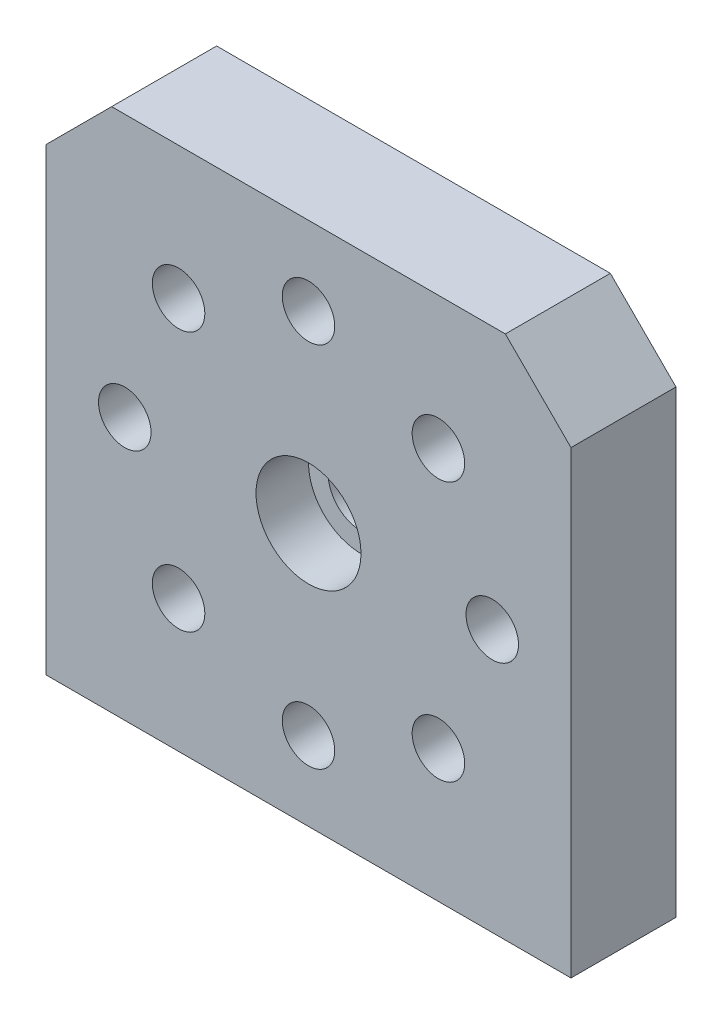
ISO-10303-21;
HEADER;
FILE_DESCRIPTION(('STEP AP214'),'2;1');
FILE_NAME('part.step','',(''),(''),'','','');
FILE_SCHEMA(('AUTOMOTIVE_DESIGN { 1 0 10303 214 1 1 1 1 }'));
ENDSEC;
DATA;
#1=APPLICATION_CONTEXT('core data for automotive mechanical design processes');
#2=APPLICATION_PROTOCOL_DEFINITION('international standard','automotive_design',2000,#1);
#3=PRODUCT_CONTEXT('',#1,'mechanical');
#4=PRODUCT('Part','Part','',(#3));
#5=PRODUCT_RELATED_PRODUCT_CATEGORY('part','',(#4));
#6=PRODUCT_DEFINITION_FORMATION('','',#4);
#7=PRODUCT_DEFINITION_CONTEXT('part definition',#1,'design');
#8=PRODUCT_DEFINITION('design','',#6,#7);
#9=PRODUCT_DEFINITION_SHAPE('','',#8);
#10=(LENGTH_UNIT() NAMED_UNIT(*) SI_UNIT(.MILLI.,.METRE.));
#11=(NAMED_UNIT(*) PLANE_ANGLE_UNIT() SI_UNIT($,.RADIAN.));
#12=(NAMED_UNIT(*) SI_UNIT($,.STERADIAN.) SOLID_ANGLE_UNIT());
#13=UNCERTAINTY_MEASURE_WITH_UNIT(LENGTH_MEASURE(1.E-05),#10,'distance_accuracy_value','');
#14=(GEOMETRIC_REPRESENTATION_CONTEXT(3) GLOBAL_UNCERTAINTY_ASSIGNED_CONTEXT((#13)) GLOBAL_UNIT_ASSIGNED_CONTEXT((#10,
#11,#12)) REPRESENTATION_CONTEXT('',''));
#15=CARTESIAN_POINT('',(0.,0.,0.));
#16=DIRECTION('',(0.,0.,1.));
#17=DIRECTION('',(1.,0.,0.));
#18=AXIS2_PLACEMENT_3D('',#15,#16,#17);
#19=CARTESIAN_POINT('',(0.,0.,8.));
#20=DIRECTION('',(0.,0.,-1.));
#21=DIRECTION('',(-1.,0.,0.));
#22=AXIS2_PLACEMENT_3D('',#19,#20,#21);
#23=CYLINDRICAL_SURFACE('',#22,2.5);
#24=CARTESIAN_POINT('',(0.,0.,0.));
#25=DIRECTION('',(0.,0.,1.));
#26=DIRECTION('',(1.,0.,0.));
#27=AXIS2_PLACEMENT_3D('',#24,#25,#26);
#28=CIRCLE('',#27,2.5);
#29=CARTESIAN_POINT('',(2.5,0.,0.));
#30=VERTEX_POINT('',#29);
#31=EDGE_CURVE('E122',#30,#30,#28,.T.);
#32=ORIENTED_EDGE('',*,*,#31,.F.);
#33=EDGE_LOOP('',(#32));
#34=FACE_BOUND('',#33,.T.);
#35=CARTESIAN_POINT('',(0.,0.,4.));
#36=DIRECTION('',(0.,0.,1.));
#37=DIRECTION('',(1.,0.,0.));
#38=AXIS2_PLACEMENT_3D('',#35,#36,#37);
#39=CIRCLE('',#38,2.5);
#40=CARTESIAN_POINT('',(2.5,0.,4.));
#41=VERTEX_POINT('',#40);
#42=EDGE_CURVE('E35',#41,#41,#39,.T.);
#43=ORIENTED_EDGE('',*,*,#42,.T.);
#44=EDGE_LOOP('',(#43));
#45=FACE_BOUND('',#44,.T.);
#46=ADVANCED_FACE('F31',(#34,#45),#23,.F.);
#47=CARTESIAN_POINT('',(-20.,-20.,8.));
#48=DIRECTION('',(0.,0.,-1.));
#49=DIRECTION('',(-1.,0.,0.));
#50=AXIS2_PLACEMENT_3D('',#47,#48,#49);
#51=PLANE('',#50);
#52=CARTESIAN_POINT('',(0.,0.,8.));
#53=DIRECTION('',(0.,0.,1.));
#54=DIRECTION('',(1.,0.,0.));
#55=AXIS2_PLACEMENT_3D('',#52,#53,#54);
#56=CIRCLE('',#55,4.);
#57=CARTESIAN_POINT('',(4.,0.,8.));
#58=VERTEX_POINT('',#57);
#59=EDGE_CURVE('E319',#58,#58,#56,.T.);
#60=ORIENTED_EDGE('',*,*,#59,.F.);
#61=EDGE_LOOP('',(#60));
#62=FACE_BOUND('',#61,.T.);
#63=CARTESIAN_POINT('',(-13.9999999999998,-2.04602083981807E-13,8.));
#64=DIRECTION('',(0.,0.,1.));
#65=DIRECTION('',(1.,0.,0.));
#66=AXIS2_PLACEMENT_3D('',#63,#64,#65);
#67=CIRCLE('',#66,2.00000000000039);
#68=CARTESIAN_POINT('',(-11.9999999999994,-2.04602083981807E-13,8.));
#69=VERTEX_POINT('',#68);
#70=EDGE_CURVE('E228',#69,#69,#67,.T.);
#71=ORIENTED_EDGE('',*,*,#70,.F.);
#72=EDGE_LOOP('',(#71));
#73=FACE_BOUND('',#72,.T.);
#74=CARTESIAN_POINT('',(3.98903336916386E-13,-14.,8.));
#75=DIRECTION('',(0.,0.,1.));
#76=DIRECTION('',(1.,0.,0.));
#77=AXIS2_PLACEMENT_3D('',#74,#75,#76);
#78=CIRCLE('',#77,2.00000000000047);
#79=CARTESIAN_POINT('',(2.00000000000087,-14.,8.));
#80=VERTEX_POINT('',#79);
#81=EDGE_CURVE('E236',#80,#80,#78,.T.);
#82=ORIENTED_EDGE('',*,*,#81,.F.);
#83=EDGE_LOOP('',(#82));
#84=FACE_BOUND('',#83,.T.);
#85=CARTESIAN_POINT('',(14.,0.,8.));
#86=DIRECTION('',(0.,0.,1.));
#87=DIRECTION('',(1.,0.,0.));
#88=AXIS2_PLACEMENT_3D('',#85,#86,#87);
#89=CIRCLE('',#88,2.);
#90=CARTESIAN_POINT('',(16.,0.,8.));
#91=VERTEX_POINT('',#90);
#92=EDGE_CURVE('E244',#91,#91,#89,.T.);
#93=ORIENTED_EDGE('',*,*,#92,.F.);
#94=EDGE_LOOP('',(#93));
#95=FACE_BOUND('',#94,.T.);
#96=CARTESIAN_POINT('',(0.,14.,8.));
#97=DIRECTION('',(0.,0.,1.));
#98=DIRECTION('',(1.,0.,0.));
#99=AXIS2_PLACEMENT_3D('',#96,#97,#98);
#100=CIRCLE('',#99,2.);
#101=CARTESIAN_POINT('',(2.,14.,8.));
#102=VERTEX_POINT('',#101);
#103=EDGE_CURVE('E191',#102,#102,#100,.T.);
#104=ORIENTED_EDGE('',*,*,#103,.F.);
#105=EDGE_LOOP('',(#104));
#106=FACE_BOUND('',#105,.T.);
#107=DIRECTION('',(1.,0.,0.));
#108=VECTOR('',#107,1.);
#109=CARTESIAN_POINT('',(20.,-20.,8.));
#110=LINE('',#109,#108);
#111=CARTESIAN_POINT('',(-20.,-20.,8.));
#112=VERTEX_POINT('',#111);
#113=CARTESIAN_POINT('',(20.,-20.,8.));
#114=VERTEX_POINT('',#113);
#115=EDGE_CURVE('E129',#112,#114,#110,.T.);
#116=ORIENTED_EDGE('',*,*,#115,.T.);
#117=DIRECTION('',(0.,1.,0.));
#118=VECTOR('',#117,1.);
#119=CARTESIAN_POINT('',(20.,15.,8.));
#120=LINE('',#119,#118);
#121=CARTESIAN_POINT('',(20.,15.,8.));
#122=VERTEX_POINT('',#121);
#123=EDGE_CURVE('E86',#114,#122,#120,.T.);
#124=ORIENTED_EDGE('',*,*,#123,.T.);
#125=DIRECTION('',(-0.707106781186548,0.707106781186548,0.));
#126=VECTOR('',#125,1.);
#127=CARTESIAN_POINT('',(15.,20.,8.));
#128=LINE('',#127,#126);
#129=CARTESIAN_POINT('',(15.,20.,8.));
#130=VERTEX_POINT('',#129);
#131=EDGE_CURVE('E100',#122,#130,#128,.T.);
#132=ORIENTED_EDGE('',*,*,#131,.T.);
#133=DIRECTION('',(-1.,0.,0.));
#134=VECTOR('',#133,1.);
#135=CARTESIAN_POINT('',(-15.,20.,8.));
#136=LINE('',#135,#134);
#137=CARTESIAN_POINT('',(-15.,20.,8.));
#138=VERTEX_POINT('',#137);
#139=EDGE_CURVE('E93',#130,#138,#136,.T.);
#140=ORIENTED_EDGE('',*,*,#139,.T.);
#141=DIRECTION('',(-0.707106781186548,-0.707106781186548,0.));
#142=VECTOR('',#141,1.);
#143=CARTESIAN_POINT('',(-15.,20.,8.));
#144=LINE('',#143,#142);
#145=CARTESIAN_POINT('',(-20.,15.,8.));
#146=VERTEX_POINT('',#145);
#147=EDGE_CURVE('E98',#138,#146,#144,.T.);
#148=ORIENTED_EDGE('',*,*,#147,.T.);
#149=DIRECTION('',(0.,-1.,0.));
#150=VECTOR('',#149,1.);
#151=CARTESIAN_POINT('',(-20.,-20.,8.));
#152=LINE('',#151,#150);
#153=EDGE_CURVE('E49',#146,#112,#152,.T.);
#154=ORIENTED_EDGE('',*,*,#153,.T.);
#155=EDGE_LOOP('',(#116,#124,#132,#140,#148,#154));
#156=FACE_BOUND('',#155,.T.);
#157=CARTESIAN_POINT('',(9.89949493661168,9.89949493661165,8.));
#158=DIRECTION('',(0.,0.,1.));
#159=DIRECTION('',(1.,0.,0.));
#160=AXIS2_PLACEMENT_3D('',#157,#158,#159);
#161=CIRCLE('',#160,2.);
#162=CARTESIAN_POINT('',(11.8994949366117,9.89949493661165,8.));
#163=VERTEX_POINT('',#162);
#164=EDGE_CURVE('E192',#163,#163,#161,.T.);
#165=ORIENTED_EDGE('',*,*,#164,.F.);
#166=EDGE_LOOP('',(#165));
#167=FACE_BOUND('',#166,.T.);
#168=CARTESIAN_POINT('',(9.899494936612,-9.89949493661153,8.));
#169=DIRECTION('',(0.,0.,1.));
#170=DIRECTION('',(1.,0.,0.));
#171=AXIS2_PLACEMENT_3D('',#168,#169,#170);
#172=CIRCLE('',#171,2.00000000000035);
#173=CARTESIAN_POINT('',(11.8994949366124,-9.89949493661153,8.));
#174=VERTEX_POINT('',#173);
#175=EDGE_CURVE('E240',#174,#174,#172,.T.);
#176=ORIENTED_EDGE('',*,*,#175,.F.);
#177=EDGE_LOOP('',(#176));
#178=FACE_BOUND('',#177,.T.);
#179=CARTESIAN_POINT('',(-9.89949493661133,-9.89949493661181,8.));
#180=DIRECTION('',(0.,0.,1.));
#181=DIRECTION('',(1.,0.,0.));
#182=AXIS2_PLACEMENT_3D('',#179,#180,#181);
#183=CIRCLE('',#182,2.00000000000049);
#184=CARTESIAN_POINT('',(-7.89949493661084,-9.89949493661181,8.));
#185=VERTEX_POINT('',#184);
#186=EDGE_CURVE('E232',#185,#185,#183,.T.);
#187=ORIENTED_EDGE('',*,*,#186,.F.);
#188=EDGE_LOOP('',(#187));
#189=FACE_BOUND('',#188,.T.);
#190=CARTESIAN_POINT('',(-9.89949493661154,9.89949493661179,8.));
#191=DIRECTION('',(0.,0.,1.));
#192=DIRECTION('',(1.,0.,0.));
#193=AXIS2_PLACEMENT_3D('',#190,#191,#192);
#194=CIRCLE('',#193,2.);
#195=CARTESIAN_POINT('',(-7.89949493661155,9.89949493661179,8.));
#196=VERTEX_POINT('',#195);
#197=EDGE_CURVE('E220',#196,#196,#194,.T.);
#198=ORIENTED_EDGE('',*,*,#197,.F.);
#199=EDGE_LOOP('',(#198));
#200=FACE_BOUND('',#199,.T.);
#201=ADVANCED_FACE('F95',(#62,#73,#84,#95,#106,#156,#167,#178,#189,#200),#51,.F.);
#202=CARTESIAN_POINT('',(-20.,-20.,0.));
#203=DIRECTION('',(0.,0.,-1.));
#204=DIRECTION('',(-1.,0.,0.));
#205=AXIS2_PLACEMENT_3D('',#202,#203,#204);
#206=PLANE('',#205);
#207=CARTESIAN_POINT('',(-13.9999999999998,-2.04602083981807E-13,0.));
#208=DIRECTION('',(0.,0.,1.));
#209=DIRECTION('',(1.,0.,0.));
#210=AXIS2_PLACEMENT_3D('',#207,#208,#209);
#211=CIRCLE('',#210,2.00000000000039);
#212=CARTESIAN_POINT('',(-11.9999999999994,-2.04602083981807E-13,0.));
#213=VERTEX_POINT('',#212);
#214=EDGE_CURVE('E178',#213,#213,#211,.T.);
#215=ORIENTED_EDGE('',*,*,#214,.T.);
#216=EDGE_LOOP('',(#215));
#217=FACE_BOUND('',#216,.T.);
#218=CARTESIAN_POINT('',(3.98903336916386E-13,-14.,0.));
#219=DIRECTION('',(0.,0.,1.));
#220=DIRECTION('',(1.,0.,0.));
#221=AXIS2_PLACEMENT_3D('',#218,#219,#220);
#222=CIRCLE('',#221,2.00000000000047);
#223=CARTESIAN_POINT('',(2.00000000000087,-14.,0.));
#224=VERTEX_POINT('',#223);
#225=EDGE_CURVE('E182',#224,#224,#222,.T.);
#226=ORIENTED_EDGE('',*,*,#225,.T.);
#227=EDGE_LOOP('',(#226));
#228=FACE_BOUND('',#227,.T.);
#229=CARTESIAN_POINT('',(14.,0.,0.));
#230=DIRECTION('',(0.,0.,1.));
#231=DIRECTION('',(1.,0.,0.));
#232=AXIS2_PLACEMENT_3D('',#229,#230,#231);
#233=CIRCLE('',#232,2.);
#234=CARTESIAN_POINT('',(16.,0.,0.));
#235=VERTEX_POINT('',#234);
#236=EDGE_CURVE('E186',#235,#235,#233,.T.);
#237=ORIENTED_EDGE('',*,*,#236,.T.);
#238=EDGE_LOOP('',(#237));
#239=FACE_BOUND('',#238,.T.);
#240=CARTESIAN_POINT('',(0.,14.,0.));
#241=DIRECTION('',(0.,0.,1.));
#242=DIRECTION('',(1.,0.,0.));
#243=AXIS2_PLACEMENT_3D('',#240,#241,#242);
#244=CIRCLE('',#243,2.);
#245=CARTESIAN_POINT('',(2.,14.,0.));
#246=VERTEX_POINT('',#245);
#247=EDGE_CURVE('E189',#246,#246,#244,.T.);
#248=ORIENTED_EDGE('',*,*,#247,.T.);
#249=EDGE_LOOP('',(#248));
#250=FACE_BOUND('',#249,.T.);
#251=DIRECTION('',(1.,0.,0.));
#252=VECTOR('',#251,1.);
#253=CARTESIAN_POINT('',(20.,-20.,0.));
#254=LINE('',#253,#252);
#255=CARTESIAN_POINT('',(-20.,-20.,0.));
#256=VERTEX_POINT('',#255);
#257=CARTESIAN_POINT('',(20.,-20.,0.));
#258=VERTEX_POINT('',#257);
#259=EDGE_CURVE('E118',#256,#258,#254,.T.);
#260=ORIENTED_EDGE('',*,*,#259,.F.);
#261=DIRECTION('',(0.,-1.,0.));
#262=VECTOR('',#261,1.);
#263=CARTESIAN_POINT('',(-20.,-20.,0.));
#264=LINE('',#263,#262);
#265=CARTESIAN_POINT('',(-20.,15.,0.));
#266=VERTEX_POINT('',#265);
#267=EDGE_CURVE('E78',#266,#256,#264,.T.);
#268=ORIENTED_EDGE('',*,*,#267,.F.);
#269=DIRECTION('',(-0.707106781186548,-0.707106781186548,0.));
#270=VECTOR('',#269,1.);
#271=CARTESIAN_POINT('',(-15.,20.,0.));
#272=LINE('',#271,#270);
#273=CARTESIAN_POINT('',(-15.,20.,0.));
#274=VERTEX_POINT('',#273);
#275=EDGE_CURVE('E72',#274,#266,#272,.T.);
#276=ORIENTED_EDGE('',*,*,#275,.F.);
#277=DIRECTION('',(-1.,0.,0.));
#278=VECTOR('',#277,1.);
#279=CARTESIAN_POINT('',(-15.,20.,0.));
#280=LINE('',#279,#278);
#281=CARTESIAN_POINT('',(15.,20.,0.));
#282=VERTEX_POINT('',#281);
#283=EDGE_CURVE('E108',#282,#274,#280,.T.);
#284=ORIENTED_EDGE('',*,*,#283,.F.);
#285=DIRECTION('',(-0.707106781186548,0.707106781186548,0.));
#286=VECTOR('',#285,1.);
#287=CARTESIAN_POINT('',(15.,20.,0.));
#288=LINE('',#287,#286);
#289=CARTESIAN_POINT('',(20.,15.,0.));
#290=VERTEX_POINT('',#289);
#291=EDGE_CURVE('E124',#290,#282,#288,.T.);
#292=ORIENTED_EDGE('',*,*,#291,.F.);
#293=DIRECTION('',(0.,1.,0.));
#294=VECTOR('',#293,1.);
#295=CARTESIAN_POINT('',(20.,15.,0.));
#296=LINE('',#295,#294);
#297=EDGE_CURVE('E121',#258,#290,#296,.T.);
#298=ORIENTED_EDGE('',*,*,#297,.F.);
#299=EDGE_LOOP('',(#260,#268,#276,#284,#292,#298));
#300=FACE_BOUND('',#299,.T.);
#301=ORIENTED_EDGE('',*,*,#31,.T.);
#302=EDGE_LOOP('',(#301));
#303=FACE_BOUND('',#302,.T.);
#304=CARTESIAN_POINT('',(9.89949493661168,9.89949493661165,0.));
#305=DIRECTION('',(0.,0.,1.));
#306=DIRECTION('',(1.,0.,0.));
#307=AXIS2_PLACEMENT_3D('',#304,#305,#306);
#308=CIRCLE('',#307,2.);
#309=CARTESIAN_POINT('',(11.8994949366117,9.89949493661165,0.));
#310=VERTEX_POINT('',#309);
#311=EDGE_CURVE('E197',#310,#310,#308,.T.);
#312=ORIENTED_EDGE('',*,*,#311,.T.);
#313=EDGE_LOOP('',(#312));
#314=FACE_BOUND('',#313,.T.);
#315=CARTESIAN_POINT('',(9.899494936612,-9.89949493661153,0.));
#316=DIRECTION('',(0.,0.,1.));
#317=DIRECTION('',(1.,0.,0.));
#318=AXIS2_PLACEMENT_3D('',#315,#316,#317);
#319=CIRCLE('',#318,2.00000000000035);
#320=CARTESIAN_POINT('',(11.8994949366124,-9.89949493661153,0.));
#321=VERTEX_POINT('',#320);
#322=EDGE_CURVE('E211',#321,#321,#319,.T.);
#323=ORIENTED_EDGE('',*,*,#322,.T.);
#324=EDGE_LOOP('',(#323));
#325=FACE_BOUND('',#324,.T.);
#326=CARTESIAN_POINT('',(-9.89949493661133,-9.89949493661181,0.));
#327=DIRECTION('',(0.,0.,1.));
#328=DIRECTION('',(1.,0.,0.));
#329=AXIS2_PLACEMENT_3D('',#326,#327,#328);
#330=CIRCLE('',#329,2.00000000000049);
#331=CARTESIAN_POINT('',(-7.89949493661084,-9.89949493661181,0.));
#332=VERTEX_POINT('',#331);
#333=EDGE_CURVE('E215',#332,#332,#330,.T.);
#334=ORIENTED_EDGE('',*,*,#333,.T.);
#335=EDGE_LOOP('',(#334));
#336=FACE_BOUND('',#335,.T.);
#337=CARTESIAN_POINT('',(-9.89949493661154,9.89949493661179,0.));
#338=DIRECTION('',(0.,0.,1.));
#339=DIRECTION('',(1.,0.,0.));
#340=AXIS2_PLACEMENT_3D('',#337,#338,#339);
#341=CIRCLE('',#340,2.);
#342=CARTESIAN_POINT('',(-7.89949493661155,9.89949493661179,0.));
#343=VERTEX_POINT('',#342);
#344=EDGE_CURVE('E218',#343,#343,#341,.T.);
#345=ORIENTED_EDGE('',*,*,#344,.T.);
#346=EDGE_LOOP('',(#345));
#347=FACE_BOUND('',#346,.T.);
#348=ADVANCED_FACE('F139',(#217,#228,#239,#250,#300,#303,#314,#325,#336,#347),#206,.T.);
#349=CARTESIAN_POINT('',(20.,-20.,8.));
#350=DIRECTION('',(0.,1.,0.));
#351=DIRECTION('',(-1.,0.,0.));
#352=AXIS2_PLACEMENT_3D('',#349,#350,#351);
#353=PLANE('',#352);
#354=CARTESIAN_POINT('',(15.5,-20.,4.));
#355=DIRECTION('',(0.,-1.,0.));
#356=DIRECTION('',(1.,0.,0.));
#357=AXIS2_PLACEMENT_3D('',#354,#355,#356);
#358=CIRCLE('',#357,2.);
#359=CARTESIAN_POINT('',(17.5,-20.,4.));
#360=VERTEX_POINT('',#359);
#361=EDGE_CURVE('E310',#360,#360,#358,.T.);
#362=ORIENTED_EDGE('',*,*,#361,.F.);
#363=EDGE_LOOP('',(#362));
#364=FACE_BOUND('',#363,.T.);
#365=CARTESIAN_POINT('',(-15.5,-20.,4.));
#366=DIRECTION('',(0.,-1.,0.));
#367=DIRECTION('',(1.,0.,0.));
#368=AXIS2_PLACEMENT_3D('',#365,#366,#367);
#369=CIRCLE('',#368,2.);
#370=CARTESIAN_POINT('',(-13.5,-20.,4.));
#371=VERTEX_POINT('',#370);
#372=EDGE_CURVE('E309',#371,#371,#369,.T.);
#373=ORIENTED_EDGE('',*,*,#372,.F.);
#374=EDGE_LOOP('',(#373));
#375=FACE_BOUND('',#374,.T.);
#376=ORIENTED_EDGE('',*,*,#259,.T.);
#377=DIRECTION('',(0.,0.,-1.));
#378=VECTOR('',#377,1.);
#379=CARTESIAN_POINT('',(20.,-20.,8.));
#380=LINE('',#379,#378);
#381=EDGE_CURVE('E11',#114,#258,#380,.T.);
#382=ORIENTED_EDGE('',*,*,#381,.F.);
#383=ORIENTED_EDGE('',*,*,#115,.F.);
#384=DIRECTION('',(0.,0.,-1.));
#385=VECTOR('',#384,1.);
#386=CARTESIAN_POINT('',(-20.,-20.,8.));
#387=LINE('',#386,#385);
#388=EDGE_CURVE('E114',#112,#256,#387,.T.);
#389=ORIENTED_EDGE('',*,*,#388,.T.);
#390=EDGE_LOOP('',(#376,#382,#383,#389));
#391=FACE_BOUND('',#390,.T.);
#392=ADVANCED_FACE('F33',(#364,#375,#391),#353,.F.);
#393=CARTESIAN_POINT('',(20.,15.,8.));
#394=DIRECTION('',(-1.,0.,0.));
#395=DIRECTION('',(0.,-1.,0.));
#396=AXIS2_PLACEMENT_3D('',#393,#394,#395);
#397=PLANE('',#396);
#398=ORIENTED_EDGE('',*,*,#297,.T.);
#399=DIRECTION('',(0.,0.,-1.));
#400=VECTOR('',#399,1.);
#401=CARTESIAN_POINT('',(20.,15.,8.));
#402=LINE('',#401,#400);
#403=EDGE_CURVE('E41',#122,#290,#402,.T.);
#404=ORIENTED_EDGE('',*,*,#403,.F.);
#405=ORIENTED_EDGE('',*,*,#123,.F.);
#406=ORIENTED_EDGE('',*,*,#381,.T.);
#407=EDGE_LOOP('',(#398,#404,#405,#406));
#408=FACE_BOUND('',#407,.T.);
#409=ADVANCED_FACE('F173',(#408),#397,.F.);
#410=CARTESIAN_POINT('',(15.,20.,8.));
#411=DIRECTION('',(-0.707106781186547,-0.707106781186547,0.));
#412=DIRECTION('',(0.707106781186548,-0.707106781186548,0.));
#413=AXIS2_PLACEMENT_3D('',#410,#411,#412);
#414=PLANE('',#413);
#415=ORIENTED_EDGE('',*,*,#291,.T.);
#416=DIRECTION('',(0.,0.,-1.));
#417=VECTOR('',#416,1.);
#418=CARTESIAN_POINT('',(15.,20.,8.));
#419=LINE('',#418,#417);
#420=EDGE_CURVE('E109',#130,#282,#419,.T.);
#421=ORIENTED_EDGE('',*,*,#420,.F.);
#422=ORIENTED_EDGE('',*,*,#131,.F.);
#423=ORIENTED_EDGE('',*,*,#403,.T.);
#424=EDGE_LOOP('',(#415,#421,#422,#423));
#425=FACE_BOUND('',#424,.T.);
#426=ADVANCED_FACE('F136',(#425),#414,.F.);
#427=CARTESIAN_POINT('',(-15.,20.,8.));
#428=DIRECTION('',(0.,-1.,0.));
#429=DIRECTION('',(1.,0.,0.));
#430=AXIS2_PLACEMENT_3D('',#427,#428,#429);
#431=PLANE('',#430);
#432=ORIENTED_EDGE('',*,*,#283,.T.);
#433=DIRECTION('',(0.,0.,-1.));
#434=VECTOR('',#433,1.);
#435=CARTESIAN_POINT('',(-15.,20.,8.));
#436=LINE('',#435,#434);
#437=EDGE_CURVE('E105',#138,#274,#436,.T.);
#438=ORIENTED_EDGE('',*,*,#437,.F.);
#439=ORIENTED_EDGE('',*,*,#139,.F.);
#440=ORIENTED_EDGE('',*,*,#420,.T.);
#441=EDGE_LOOP('',(#432,#438,#439,#440));
#442=FACE_BOUND('',#441,.T.);
#443=ADVANCED_FACE('F106',(#442),#431,.F.);
#444=CARTESIAN_POINT('',(-15.,20.,8.));
#445=DIRECTION('',(0.707106781186547,-0.707106781186547,0.));
#446=DIRECTION('',(0.707106781186548,0.707106781186548,0.));
#447=AXIS2_PLACEMENT_3D('',#444,#445,#446);
#448=PLANE('',#447);
#449=ORIENTED_EDGE('',*,*,#275,.T.);
#450=DIRECTION('',(0.,0.,-1.));
#451=VECTOR('',#450,1.);
#452=CARTESIAN_POINT('',(-20.,15.,8.));
#453=LINE('',#452,#451);
#454=EDGE_CURVE('E110',#146,#266,#453,.T.);
#455=ORIENTED_EDGE('',*,*,#454,.F.);
#456=ORIENTED_EDGE('',*,*,#147,.F.);
#457=ORIENTED_EDGE('',*,*,#437,.T.);
#458=EDGE_LOOP('',(#449,#455,#456,#457));
#459=FACE_BOUND('',#458,.T.);
#460=ADVANCED_FACE('F112',(#459),#448,.F.);
#461=CARTESIAN_POINT('',(-20.,-20.,8.));
#462=DIRECTION('',(1.,0.,0.));
#463=DIRECTION('',(0.,1.,0.));
#464=AXIS2_PLACEMENT_3D('',#461,#462,#463);
#465=PLANE('',#464);
#466=ORIENTED_EDGE('',*,*,#267,.T.);
#467=ORIENTED_EDGE('',*,*,#388,.F.);
#468=ORIENTED_EDGE('',*,*,#153,.F.);
#469=ORIENTED_EDGE('',*,*,#454,.T.);
#470=EDGE_LOOP('',(#466,#467,#468,#469));
#471=FACE_BOUND('',#470,.T.);
#472=ADVANCED_FACE('F144',(#471),#465,.F.);
#473=CARTESIAN_POINT('',(0.,14.,8.));
#474=DIRECTION('',(0.,0.,-1.));
#475=DIRECTION('',(-1.,0.,0.));
#476=AXIS2_PLACEMENT_3D('',#473,#474,#475);
#477=CYLINDRICAL_SURFACE('',#476,2.);
#478=ORIENTED_EDGE('',*,*,#103,.T.);
#479=EDGE_LOOP('',(#478));
#480=FACE_BOUND('',#479,.T.);
#481=ORIENTED_EDGE('',*,*,#247,.F.);
#482=EDGE_LOOP('',(#481));
#483=FACE_BOUND('',#482,.T.);
#484=ADVANCED_FACE('F146',(#480,#483),#477,.F.);
#485=CARTESIAN_POINT('',(9.89949493661168,9.89949493661165,8.));
#486=DIRECTION('',(0.,0.,-1.));
#487=DIRECTION('',(-1.,0.,0.));
#488=AXIS2_PLACEMENT_3D('',#485,#486,#487);
#489=CYLINDRICAL_SURFACE('',#488,2.);
#490=ORIENTED_EDGE('',*,*,#164,.T.);
#491=EDGE_LOOP('',(#490));
#492=FACE_BOUND('',#491,.T.);
#493=ORIENTED_EDGE('',*,*,#311,.F.);
#494=EDGE_LOOP('',(#493));
#495=FACE_BOUND('',#494,.T.);
#496=ADVANCED_FACE('F152',(#492,#495),#489,.F.);
#497=CARTESIAN_POINT('',(14.,0.,8.));
#498=DIRECTION('',(0.,0.,-1.));
#499=DIRECTION('',(-1.,0.,0.));
#500=AXIS2_PLACEMENT_3D('',#497,#498,#499);
#501=CYLINDRICAL_SURFACE('',#500,2.);
#502=ORIENTED_EDGE('',*,*,#92,.T.);
#503=EDGE_LOOP('',(#502));
#504=FACE_BOUND('',#503,.T.);
#505=ORIENTED_EDGE('',*,*,#236,.F.);
#506=EDGE_LOOP('',(#505));
#507=FACE_BOUND('',#506,.T.);
#508=ADVANCED_FACE('F249',(#504,#507),#501,.F.);
#509=CARTESIAN_POINT('',(9.899494936612,-9.89949493661153,8.));
#510=DIRECTION('',(0.,0.,-1.));
#511=DIRECTION('',(-1.,0.,0.));
#512=AXIS2_PLACEMENT_3D('',#509,#510,#511);
#513=CYLINDRICAL_SURFACE('',#512,2.00000000000035);
#514=ORIENTED_EDGE('',*,*,#175,.T.);
#515=EDGE_LOOP('',(#514));
#516=FACE_BOUND('',#515,.T.);
#517=ORIENTED_EDGE('',*,*,#322,.F.);
#518=EDGE_LOOP('',(#517));
#519=FACE_BOUND('',#518,.T.);
#520=ADVANCED_FACE('F255',(#516,#519),#513,.F.);
#521=CARTESIAN_POINT('',(3.98903336916386E-13,-14.,8.));
#522=DIRECTION('',(0.,0.,-1.));
#523=DIRECTION('',(-1.,0.,0.));
#524=AXIS2_PLACEMENT_3D('',#521,#522,#523);
#525=CYLINDRICAL_SURFACE('',#524,2.00000000000047);
#526=ORIENTED_EDGE('',*,*,#81,.T.);
#527=EDGE_LOOP('',(#526));
#528=FACE_BOUND('',#527,.T.);
#529=ORIENTED_EDGE('',*,*,#225,.F.);
#530=EDGE_LOOP('',(#529));
#531=FACE_BOUND('',#530,.T.);
#532=ADVANCED_FACE('F261',(#528,#531),#525,.F.);
#533=CARTESIAN_POINT('',(-9.89949493661133,-9.89949493661181,8.));
#534=DIRECTION('',(0.,0.,-1.));
#535=DIRECTION('',(-1.,0.,0.));
#536=AXIS2_PLACEMENT_3D('',#533,#534,#535);
#537=CYLINDRICAL_SURFACE('',#536,2.00000000000049);
#538=ORIENTED_EDGE('',*,*,#186,.T.);
#539=EDGE_LOOP('',(#538));
#540=FACE_BOUND('',#539,.T.);
#541=ORIENTED_EDGE('',*,*,#333,.F.);
#542=EDGE_LOOP('',(#541));
#543=FACE_BOUND('',#542,.T.);
#544=ADVANCED_FACE('F268',(#540,#543),#537,.F.);
#545=CARTESIAN_POINT('',(-13.9999999999998,-2.04602083981807E-13,8.));
#546=DIRECTION('',(0.,0.,-1.));
#547=DIRECTION('',(-1.,0.,0.));
#548=AXIS2_PLACEMENT_3D('',#545,#546,#547);
#549=CYLINDRICAL_SURFACE('',#548,2.00000000000039);
#550=ORIENTED_EDGE('',*,*,#70,.T.);
#551=EDGE_LOOP('',(#550));
#552=FACE_BOUND('',#551,.T.);
#553=ORIENTED_EDGE('',*,*,#214,.F.);
#554=EDGE_LOOP('',(#553));
#555=FACE_BOUND('',#554,.T.);
#556=ADVANCED_FACE('F272',(#552,#555),#549,.F.);
#557=CARTESIAN_POINT('',(-9.89949493661154,9.89949493661179,8.));
#558=DIRECTION('',(0.,0.,-1.));
#559=DIRECTION('',(-1.,0.,0.));
#560=AXIS2_PLACEMENT_3D('',#557,#558,#559);
#561=CYLINDRICAL_SURFACE('',#560,2.);
#562=ORIENTED_EDGE('',*,*,#197,.T.);
#563=EDGE_LOOP('',(#562));
#564=FACE_BOUND('',#563,.T.);
#565=ORIENTED_EDGE('',*,*,#344,.F.);
#566=EDGE_LOOP('',(#565));
#567=FACE_BOUND('',#566,.T.);
#568=ADVANCED_FACE('F276',(#564,#567),#561,.F.);
#569=CARTESIAN_POINT('',(0.,0.,4.));
#570=DIRECTION('',(0.,0.,1.));
#571=DIRECTION('',(1.,0.,0.));
#572=AXIS2_PLACEMENT_3D('',#569,#570,#571);
#573=CYLINDRICAL_SURFACE('',#572,4.);
#574=CARTESIAN_POINT('',(0.,0.,4.));
#575=DIRECTION('',(0.,0.,1.));
#576=DIRECTION('',(1.,0.,0.));
#577=AXIS2_PLACEMENT_3D('',#574,#575,#576);
#578=CIRCLE('',#577,4.);
#579=CARTESIAN_POINT('',(4.,0.,4.));
#580=VERTEX_POINT('',#579);
#581=EDGE_CURVE('E225',#580,#580,#578,.T.);
#582=ORIENTED_EDGE('',*,*,#581,.F.);
#583=EDGE_LOOP('',(#582));
#584=FACE_BOUND('',#583,.T.);
#585=ORIENTED_EDGE('',*,*,#59,.T.);
#586=EDGE_LOOP('',(#585));
#587=FACE_BOUND('',#586,.T.);
#588=ADVANCED_FACE('F280',(#584,#587),#573,.F.);
#589=CARTESIAN_POINT('',(0.,0.,4.));
#590=DIRECTION('',(0.,0.,1.));
#591=DIRECTION('',(1.,0.,0.));
#592=AXIS2_PLACEMENT_3D('',#589,#590,#591);
#593=PLANE('',#592);
#594=ORIENTED_EDGE('',*,*,#42,.F.);
#595=EDGE_LOOP('',(#594));
#596=FACE_BOUND('',#595,.T.);
#597=ORIENTED_EDGE('',*,*,#581,.T.);
#598=EDGE_LOOP('',(#597));
#599=FACE_BOUND('',#598,.T.);
#600=ADVANCED_FACE('F284',(#596,#599),#593,.T.);
#601=CARTESIAN_POINT('',(-15.5,-5.,4.));
#602=DIRECTION('',(0.,-1.,0.));
#603=DIRECTION('',(1.,0.,0.));
#604=AXIS2_PLACEMENT_3D('',#601,#602,#603);
#605=CYLINDRICAL_SURFACE('',#604,2.);
#606=CARTESIAN_POINT('',(-15.5,-5.,4.));
#607=DIRECTION('',(0.,-1.,0.));
#608=DIRECTION('',(1.,0.,0.));
#609=AXIS2_PLACEMENT_3D('',#606,#607,#608);
#610=CIRCLE('',#609,2.);
#611=CARTESIAN_POINT('',(-13.5,-5.,4.));
#612=VERTEX_POINT('',#611);
#613=EDGE_CURVE('E313',#612,#612,#610,.T.);
#614=ORIENTED_EDGE('',*,*,#613,.F.);
#615=EDGE_LOOP('',(#614));
#616=FACE_BOUND('',#615,.T.);
#617=ORIENTED_EDGE('',*,*,#372,.T.);
#618=EDGE_LOOP('',(#617));
#619=FACE_BOUND('',#618,.T.);
#620=ADVANCED_FACE('F288',(#616,#619),#605,.F.);
#621=CARTESIAN_POINT('',(-15.5,-5.,4.));
#622=DIRECTION('',(0.,-1.,0.));
#623=DIRECTION('',(1.,0.,0.));
#624=AXIS2_PLACEMENT_3D('',#621,#622,#623);
#625=PLANE('',#624);
#626=ORIENTED_EDGE('',*,*,#613,.T.);
#627=EDGE_LOOP('',(#626));
#628=FACE_BOUND('',#627,.T.);
#629=ADVANCED_FACE('F292',(#628),#625,.T.);
#630=CARTESIAN_POINT('',(15.5,-5.,4.));
#631=DIRECTION('',(0.,-1.,0.));
#632=DIRECTION('',(1.,0.,0.));
#633=AXIS2_PLACEMENT_3D('',#630,#631,#632);
#634=CYLINDRICAL_SURFACE('',#633,2.);
#635=CARTESIAN_POINT('',(15.5,-5.,4.));
#636=DIRECTION('',(0.,-1.,0.));
#637=DIRECTION('',(1.,0.,0.));
#638=AXIS2_PLACEMENT_3D('',#635,#636,#637);
#639=CIRCLE('',#638,2.);
#640=CARTESIAN_POINT('',(17.5,-5.,4.));
#641=VERTEX_POINT('',#640);
#642=EDGE_CURVE('E308',#641,#641,#639,.T.);
#643=ORIENTED_EDGE('',*,*,#642,.F.);
#644=EDGE_LOOP('',(#643));
#645=FACE_BOUND('',#644,.T.);
#646=ORIENTED_EDGE('',*,*,#361,.T.);
#647=EDGE_LOOP('',(#646));
#648=FACE_BOUND('',#647,.T.);
#649=ADVANCED_FACE('F296',(#645,#648),#634,.F.);
#650=CARTESIAN_POINT('',(15.5,-5.,4.));
#651=DIRECTION('',(0.,-1.,0.));
#652=DIRECTION('',(1.,0.,0.));
#653=AXIS2_PLACEMENT_3D('',#650,#651,#652);
#654=PLANE('',#653);
#655=ORIENTED_EDGE('',*,*,#642,.T.);
#656=EDGE_LOOP('',(#655));
#657=FACE_BOUND('',#656,.T.);
#658=ADVANCED_FACE('F300',(#657),#654,.T.);
#659=CLOSED_SHELL('',(#46,#201,#348,#392,#409,#426,#443,#460,#472,#484,#496,#508,#520,#532,#544,
#556,#568,#588,#600,#620,#629,#649,#658));
#660=MANIFOLD_SOLID_BREP('B2',#659);
#661=ADVANCED_BREP_SHAPE_REPRESENTATION('',(#18,#660),#14);
#662=SHAPE_DEFINITION_REPRESENTATION(#9,#661);
ENDSEC;
END-ISO-10303-21;
